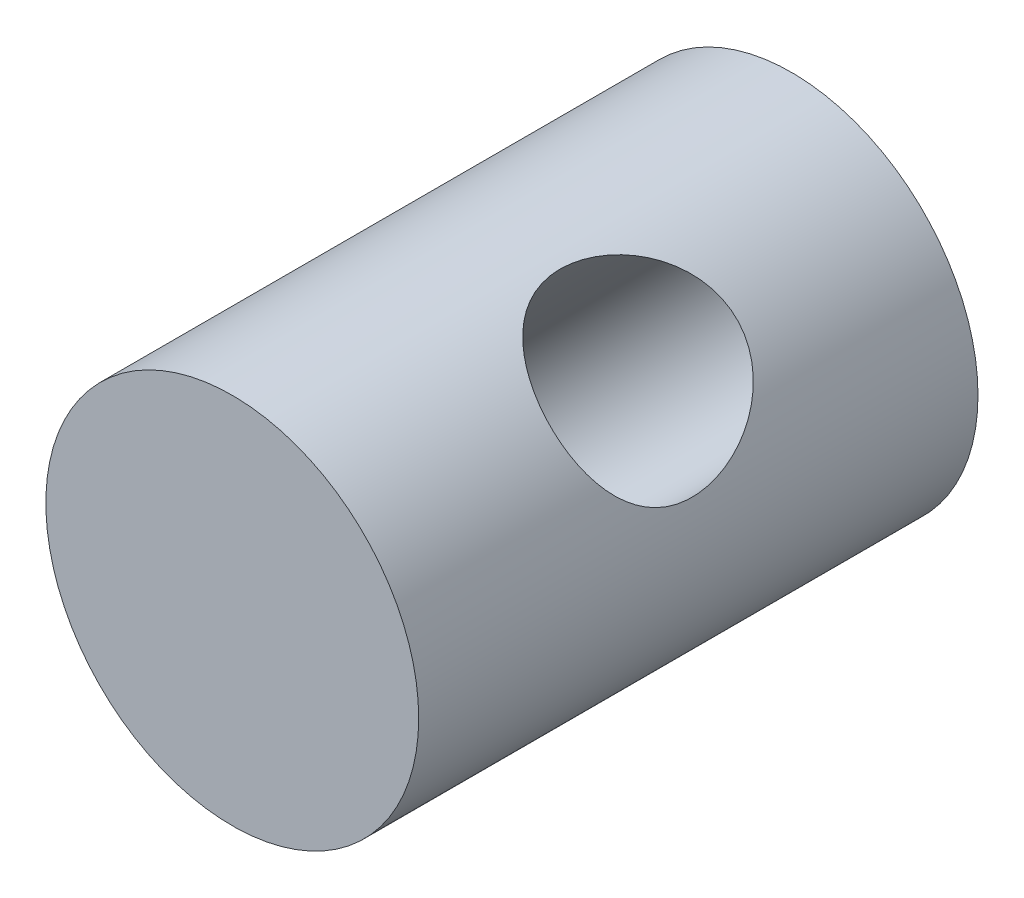
ISO-10303-21;
HEADER;
FILE_DESCRIPTION(('STEP AP214'),'2;1');
FILE_NAME('part.step','',(''),(''),'','','');
FILE_SCHEMA(('AUTOMOTIVE_DESIGN { 1 0 10303 214 1 1 1 1 }'));
ENDSEC;
DATA;
#1=APPLICATION_CONTEXT('core data for automotive mechanical design processes');
#2=APPLICATION_PROTOCOL_DEFINITION('international standard','automotive_design',2000,#1);
#3=PRODUCT_CONTEXT('',#1,'mechanical');
#4=PRODUCT('Part','Part','',(#3));
#5=PRODUCT_RELATED_PRODUCT_CATEGORY('part','',(#4));
#6=PRODUCT_DEFINITION_FORMATION('','',#4);
#7=PRODUCT_DEFINITION_CONTEXT('part definition',#1,'design');
#8=PRODUCT_DEFINITION('design','',#6,#7);
#9=PRODUCT_DEFINITION_SHAPE('','',#8);
#10=(LENGTH_UNIT() NAMED_UNIT(*) SI_UNIT(.MILLI.,.METRE.));
#11=(NAMED_UNIT(*) PLANE_ANGLE_UNIT() SI_UNIT($,.RADIAN.));
#12=(NAMED_UNIT(*) SI_UNIT($,.STERADIAN.) SOLID_ANGLE_UNIT());
#13=UNCERTAINTY_MEASURE_WITH_UNIT(LENGTH_MEASURE(1.E-05),#10,'distance_accuracy_value','');
#14=(GEOMETRIC_REPRESENTATION_CONTEXT(3) GLOBAL_UNCERTAINTY_ASSIGNED_CONTEXT((#13)) GLOBAL_UNIT_ASSIGNED_CONTEXT((#10,
#11,#12)) REPRESENTATION_CONTEXT('',''));
#15=CARTESIAN_POINT('',(0.,0.,0.));
#16=DIRECTION('',(0.,0.,1.));
#17=DIRECTION('',(1.,0.,0.));
#18=AXIS2_PLACEMENT_3D('',#15,#16,#17);
#19=CARTESIAN_POINT('',(0.,0.,12.));
#20=DIRECTION('',(0.,0.,-1.));
#21=DIRECTION('',(-1.,0.,0.));
#22=AXIS2_PLACEMENT_3D('',#19,#20,#21);
#23=CYLINDRICAL_SURFACE('',#22,4.);
#24=CARTESIAN_POINT('',(-3.86370330515627,-1.03527618041009,6.));
#25=CARTESIAN_POINT('',(-3.86370459881444,-1.0352893711571,6.10421320547434));
#26=CARTESIAN_POINT('',(-3.86128100934837,-1.04445095043979,6.2085621765338));
#27=CARTESIAN_POINT('',(-3.8513940803619,-1.08031794598724,6.4140551772306));
#28=CARTESIAN_POINT('',(-3.84392015002066,-1.1070602266733,6.51519200324776));
#29=CARTESIAN_POINT('',(-3.82345847525807,-1.17576810402632,6.71090315644693));
#30=CARTESIAN_POINT('',(-3.81049999591903,-1.21765273191303,6.80550925884925));
#31=CARTESIAN_POINT('',(-3.77834613351914,-1.31402940114761,6.98684845047615));
#32=CARTESIAN_POINT('',(-3.75915041303457,-1.36852212452518,7.07358111343677));
#33=CARTESIAN_POINT('',(-3.71179474047926,-1.49242262258695,7.24461144313338));
#34=CARTESIAN_POINT('',(-3.68302601797015,-1.5626898672979,7.32811826759177));
#35=CARTESIAN_POINT('',(-3.6161067938154,-1.71185746004076,7.4828167805706));
#36=CARTESIAN_POINT('',(-3.57795163529628,-1.79076208249943,7.55400232620397));
#37=CARTESIAN_POINT('',(-3.48844672204306,-1.95971138096949,7.6867343011885));
#38=CARTESIAN_POINT('',(-3.43638092272623,-2.05014845548512,7.74730753542331));
#39=CARTESIAN_POINT('',(-3.32009909967182,-2.23353894528091,7.85028170678709));
#40=CARTESIAN_POINT('',(-3.25589078089575,-2.32649073298615,7.8926941123508));
#41=CARTESIAN_POINT('',(-3.12095657273504,-2.50423233896791,7.95500932253118));
#42=CARTESIAN_POINT('',(-3.05101952081114,-2.58913230708547,7.9762990526921));
#43=CARTESIAN_POINT('',(-2.90288047261229,-2.75418828042584,8.00033223736903));
#44=CARTESIAN_POINT('',(-2.82468350628804,-2.83434712692783,8.00308691359628));
#45=CARTESIAN_POINT('',(-2.66974853723372,-2.98040182849614,7.99050665205486));
#46=CARTESIAN_POINT('',(-2.59347500057566,-3.04693182899992,7.97672396895636));
#47=CARTESIAN_POINT('',(-2.43871042756156,-3.17216053387482,7.93423831219188));
#48=CARTESIAN_POINT('',(-2.36021922568681,-3.23085865182079,7.90553422204788));
#49=CARTESIAN_POINT('',(-2.20250531142357,-3.34040810707925,7.83383486782005));
#50=CARTESIAN_POINT('',(-2.12328750299556,-3.3911396448263,7.79064737365578));
#51=CARTESIAN_POINT('',(-1.96773626752486,-3.48370759115982,7.6914731675971));
#52=CARTESIAN_POINT('',(-1.89140388456175,-3.52554080478518,7.63548187339533));
#53=CARTESIAN_POINT('',(-1.73703649261151,-3.60428958213898,7.50620929693394));
#54=CARTESIAN_POINT('',(-1.65952260135772,-3.64036649555481,7.43179394334797));
#55=CARTESIAN_POINT('',(-1.51382940179714,-3.70332720013195,7.27082055013965));
#56=CARTESIAN_POINT('',(-1.4456572872441,-3.73020393016802,7.18425325545188));
#57=CARTESIAN_POINT('',(-1.3179568504757,-3.77728932408925,6.99470361515182));
#58=CARTESIAN_POINT('',(-1.25925236275468,-3.79696615323056,6.89102795389158));
#59=CARTESIAN_POINT('',(-1.16027085528413,-3.82838022178834,6.674124657282));
#60=CARTESIAN_POINT('',(-1.11997461107766,-3.84012575033586,6.56090713396488));
#61=CARTESIAN_POINT('',(-1.06386498780704,-3.85603227368294,6.33757097743442));
#62=CARTESIAN_POINT('',(-1.04636450399107,-3.86072054919911,6.2279177619129));
#63=CARTESIAN_POINT('',(-1.03189824566562,-3.86461594335437,6.00719731696691));
#64=CARTESIAN_POINT('',(-1.03491796578461,-3.86382693378153,5.8961311417604));
#65=CARTESIAN_POINT('',(-1.05968057724537,-3.8570969495911,5.68869216284256));
#66=CARTESIAN_POINT('',(-1.07933918703677,-3.85172899517205,5.59204109778422));
#67=CARTESIAN_POINT('',(-1.13313003382098,-3.83624732829456,5.40326442745801));
#68=CARTESIAN_POINT('',(-1.16726695795744,-3.82613207885531,5.31114029850652));
#69=CARTESIAN_POINT('',(-1.24976121811304,-3.80000571468505,5.12917733819489));
#70=CARTESIAN_POINT('',(-1.29870394849983,-3.78374322988911,5.03964196629395));
#71=CARTESIAN_POINT('',(-1.40753017427794,-3.74462291896735,4.86906145692096));
#72=CARTESIAN_POINT('',(-1.46741928775995,-3.7217617026214,4.78802071296949));
#73=CARTESIAN_POINT('',(-1.60377873262909,-3.66524154585663,4.62604246495734));
#74=CARTESIAN_POINT('',(-1.68138757944598,-3.63058476054877,4.54640569858222));
#75=CARTESIAN_POINT('',(-1.84404659815511,-3.5507322401369,4.40117552399527));
#76=CARTESIAN_POINT('',(-1.92909927002594,-3.5055329558257,4.33558685947316));
#77=CARTESIAN_POINT('',(-2.10559182003165,-3.4025256771348,4.21885254816729));
#78=CARTESIAN_POINT('',(-2.19714102664403,-3.3444163981957,4.16813376383323));
#79=CARTESIAN_POINT('',(-2.38056150742932,-3.21642497959979,4.08572419203039));
#80=CARTESIAN_POINT('',(-2.47243242721346,-3.14655324686928,4.0540166963159));
#81=CARTESIAN_POINT('',(-2.64414859154452,-3.00330136916831,4.01326287251486));
#82=CARTESIAN_POINT('',(-2.72432380326583,-2.93083135085755,4.00240425133572));
#83=CARTESIAN_POINT('',(-2.87869858365822,-2.77934729282199,3.99831346600433));
#84=CARTESIAN_POINT('',(-2.95290023480643,-2.70033555329973,4.00507513147113));
#85=CARTESIAN_POINT('',(-3.0884694356153,-2.54388975347637,4.03483282431641));
#86=CARTESIAN_POINT('',(-3.15036049200075,-2.46669480823201,4.05672973730905));
#87=CARTESIAN_POINT('',(-3.26593797100563,-2.31149669440089,4.11465395980667));
#88=CARTESIAN_POINT('',(-3.31962321548962,-2.23349341147187,4.15068329570691));
#89=CARTESIAN_POINT('',(-3.42053391102493,-2.07583342321291,4.2374542549914));
#90=CARTESIAN_POINT('',(-3.46738486763519,-1.99624869216631,4.28875921975186));
#91=CARTESIAN_POINT('',(-3.55201788731206,-1.8414569996925,4.40391528811809));
#92=CARTESIAN_POINT('',(-3.58979576730867,-1.76625206959521,4.46777215410157));
#93=CARTESIAN_POINT('',(-3.66026791477986,-1.61555786947553,4.61359663555941));
#94=CARTESIAN_POINT('',(-3.69208209776399,-1.54078515186373,4.69673418080029));
#95=CARTESIAN_POINT('',(-3.74666670664265,-1.40285481283078,4.87489222830609));
#96=CARTESIAN_POINT('',(-3.7694291430603,-1.33970747877439,4.96992313136052));
#97=CARTESIAN_POINT('',(-3.80767032151753,-1.2269184524633,5.17330889413024));
#98=CARTESIAN_POINT('',(-3.82289615256722,-1.17776662816843,5.28198991073527));
#99=CARTESIAN_POINT('',(-3.84024140403409,-1.11935207552343,5.45057811963094));
#100=CARTESIAN_POINT('',(-3.84510564702044,-1.10244115407729,5.50764782059068));
#101=CARTESIAN_POINT('',(-3.8531247587118,-1.0740809843713,5.62323255750019));
#102=CARTESIAN_POINT('',(-3.85628082270828,-1.06262791767177,5.68174655275425));
#103=CARTESIAN_POINT('',(-3.86032188599497,-1.04783389616825,5.78360078924729));
#104=CARTESIAN_POINT('',(-3.86159132004935,-1.04313310007072,5.82673305725007));
#105=CARTESIAN_POINT('',(-3.86328178867122,-1.03685139155021,5.9132356930929));
#106=CARTESIAN_POINT('',(-3.86370276648266,-1.03527068784068,5.9566060766667));
#107=CARTESIAN_POINT('',(-3.86370330515627,-1.03527618041009,6.));
#108=B_SPLINE_CURVE_WITH_KNOTS('',3,(#24,#25,#26,#27,#28,#29,#30,#31,#32,#33,#34,#35,#36,#37,
#38,#39,#40,#41,#42,#43,#44,#45,#46,#47,#48,#49,#50,#51,#52,#53,#54,#55,#56,#57,#58,#59,#60,#61,
#62,#63,#64,#65,#66,#67,#68,#69,#70,#71,#72,#73,#74,#75,#76,#77,#78,#79,#80,#81,#82,#83,#84,#85,
#86,#87,#88,#89,#90,#91,#92,#93,#94,#95,#96,#97,#98,#99,#100,#101,#102,#103,#104,#105,#106,
#107),.UNSPECIFIED.,.T.,.F.,(4,2,2,2,2,2,2,2,2,2,2,2,2,2,2,2,2,2,2,2,2,2,2,2,2,2,2,2,2,2,2,2,2,
2,2,2,2,2,2,2,2,4),(0.,0.312464245189432,0.62558578564961,0.937057191861536,1.24854545093096,
1.58572462503713,1.92307142172809,2.28315784481594,2.64301653931849,2.97726969939937,
3.31132047376147,3.61632194973143,3.92134625038977,4.2305906946636,4.5399459870461,
4.87854382917848,5.21740096495904,5.57777683462963,5.93777548427476,6.2692458171249,
6.60048186380813,6.89548366852118,7.19058104876193,7.49934592816242,7.80826972444161,
8.15613487165293,8.50411729960471,8.86128362829998,9.2181355962161,9.5422454078304,
9.8662417359201,10.1688884974705,10.4715786702809,10.7872150144301,11.1029966020551,
11.450204837042,11.7977188569438,12.1562149808128,12.3351395323571,12.5139387197526,
12.6440387634036,12.7741475095882),.UNSPECIFIED.);
#109=CARTESIAN_POINT('',(-3.86370330515627,-1.03527618041009,6.));
#110=VERTEX_POINT('',#109);
#111=EDGE_CURVE('E35',#110,#110,#108,.T.);
#112=ORIENTED_EDGE('',*,*,#111,.T.);
#113=EDGE_LOOP('',(#112));
#114=FACE_BOUND('',#113,.T.);
#115=CARTESIAN_POINT('',(1.03527618041008,3.86370330515628,6.));
#116=CARTESIAN_POINT('',(1.03528937115708,3.86370459881445,5.89578679452566));
#117=CARTESIAN_POINT('',(1.04445095043978,3.86128100934838,5.7914378234662));
#118=CARTESIAN_POINT('',(1.08031794598723,3.8513940803619,5.5859448227694));
#119=CARTESIAN_POINT('',(1.10706022667329,3.84392015002067,5.48480799675224));
#120=CARTESIAN_POINT('',(1.17576810402631,3.82345847525807,5.28909684355307));
#121=CARTESIAN_POINT('',(1.21765273191302,3.81049999591904,5.19449074115075));
#122=CARTESIAN_POINT('',(1.3140294011476,3.77834613351914,5.01315154952385));
#123=CARTESIAN_POINT('',(1.36852212452517,3.75915041303458,4.92641888656323));
#124=CARTESIAN_POINT('',(1.49242262258694,3.71179474047926,4.75538855686662));
#125=CARTESIAN_POINT('',(1.56268986729789,3.68302601797015,4.67188173240823));
#126=CARTESIAN_POINT('',(1.71185746004075,3.61610679381541,4.5171832194294));
#127=CARTESIAN_POINT('',(1.79076208249942,3.57795163529629,4.44599767379603));
#128=CARTESIAN_POINT('',(1.95971138096948,3.48844672204306,4.3132656988115));
#129=CARTESIAN_POINT('',(2.0501484554851,3.43638092272623,4.25269246457669));
#130=CARTESIAN_POINT('',(2.2335389452809,3.32009909967182,4.14971829321291));
#131=CARTESIAN_POINT('',(2.32649073298614,3.25589078089575,4.1073058876492));
#132=CARTESIAN_POINT('',(2.5042323389679,3.12095657273504,4.04499067746882));
#133=CARTESIAN_POINT('',(2.58913230708546,3.05101952081115,4.0237009473079));
#134=CARTESIAN_POINT('',(2.75418828042583,2.9028804726123,3.99966776263097));
#135=CARTESIAN_POINT('',(2.83434712692782,2.82468350628805,3.99691308640372));
#136=CARTESIAN_POINT('',(2.98040182849614,2.66974853723373,4.00949334794514));
#137=CARTESIAN_POINT('',(3.04693182899991,2.59347500057567,4.02327603104364));
#138=CARTESIAN_POINT('',(3.17216053387481,2.43871042756157,4.06576168780812));
#139=CARTESIAN_POINT('',(3.23085865182079,2.36021922568682,4.09446577795212));
#140=CARTESIAN_POINT('',(3.34040810707925,2.20250531142358,4.16616513217995));
#141=CARTESIAN_POINT('',(3.39113964482629,2.12328750299557,4.20935262634422));
#142=CARTESIAN_POINT('',(3.48370759115981,1.96773626752487,4.3085268324029));
#143=CARTESIAN_POINT('',(3.52554080478517,1.89140388456176,4.36451812660468));
#144=CARTESIAN_POINT('',(3.60428958213898,1.73703649261152,4.49379070306606));
#145=CARTESIAN_POINT('',(3.64036649555481,1.65952260135774,4.56820605665203));
#146=CARTESIAN_POINT('',(3.70332720013195,1.51382940179715,4.72917944986035));
#147=CARTESIAN_POINT('',(3.73020393016802,1.44565728724411,4.81574674454812));
#148=CARTESIAN_POINT('',(3.77728932408925,1.31795685047571,5.00529638484818));
#149=CARTESIAN_POINT('',(3.79696615323056,1.2592523627547,5.10897204610842));
#150=CARTESIAN_POINT('',(3.82838022178833,1.16027085528414,5.325875342718));
#151=CARTESIAN_POINT('',(3.84012575033586,1.11997461107767,5.43909286603513));
#152=CARTESIAN_POINT('',(3.85603227368293,1.06386498780705,5.66242902256558));
#153=CARTESIAN_POINT('',(3.8607205491991,1.04636450399108,5.7720822380871));
#154=CARTESIAN_POINT('',(3.86461594335437,1.03189824566564,5.99280268303309));
#155=CARTESIAN_POINT('',(3.86382693378152,1.03491796578462,6.1038688582396));
#156=CARTESIAN_POINT('',(3.8570969495911,1.05968057724539,6.31130783715744));
#157=CARTESIAN_POINT('',(3.85172899517205,1.07933918703678,6.40795890221578));
#158=CARTESIAN_POINT('',(3.83624732829456,1.133130033821,6.59673557254199));
#159=CARTESIAN_POINT('',(3.82613207885531,1.16726695795746,6.68885970149348));
#160=CARTESIAN_POINT('',(3.80000571468505,1.24976121811306,6.87082266180511));
#161=CARTESIAN_POINT('',(3.7837432298891,1.29870394849984,6.96035803370605));
#162=CARTESIAN_POINT('',(3.74462291896735,1.40753017427796,7.13093854307904));
#163=CARTESIAN_POINT('',(3.7217617026214,1.46741928775996,7.21197928703051));
#164=CARTESIAN_POINT('',(3.66524154585663,1.6037787326291,7.37395753504266));
#165=CARTESIAN_POINT('',(3.63058476054876,1.68138757944599,7.45359430141778));
#166=CARTESIAN_POINT('',(3.5507322401369,1.84404659815512,7.59882447600473));
#167=CARTESIAN_POINT('',(3.50553295582569,1.92909927002595,7.66441314052684));
#168=CARTESIAN_POINT('',(3.4025256771348,2.10559182003166,7.78114745183271));
#169=CARTESIAN_POINT('',(3.34441639819569,2.19714102664404,7.83186623616677));
#170=CARTESIAN_POINT('',(3.21642497959979,2.38056150742934,7.91427580796961));
#171=CARTESIAN_POINT('',(3.14655324686927,2.47243242721347,7.9459833036841));
#172=CARTESIAN_POINT('',(3.0033013691683,2.64414859154453,7.98673712748514));
#173=CARTESIAN_POINT('',(2.93083135085754,2.72432380326584,7.99759574866427));
#174=CARTESIAN_POINT('',(2.77934729282198,2.87869858365823,8.00168653399567));
#175=CARTESIAN_POINT('',(2.70033555329972,2.95290023480644,7.99492486852887));
#176=CARTESIAN_POINT('',(2.54388975347636,3.08846943561531,7.9651671756836));
#177=CARTESIAN_POINT('',(2.466694808232,3.15036049200076,7.94327026269095));
#178=CARTESIAN_POINT('',(2.31149669440088,3.26593797100564,7.88534604019333));
#179=CARTESIAN_POINT('',(2.23349341147186,3.31962321548963,7.84931670429309));
#180=CARTESIAN_POINT('',(2.0758334232129,3.42053391102494,7.7625457450086));
#181=CARTESIAN_POINT('',(1.99624869216629,3.4673848676352,7.71124078024814));
#182=CARTESIAN_POINT('',(1.84145699969248,3.55201788731207,7.5960847118819));
#183=CARTESIAN_POINT('',(1.7662520695952,3.58979576730868,7.53222784589843));
#184=CARTESIAN_POINT('',(1.61555786947552,3.66026791477986,7.38640336444058));
#185=CARTESIAN_POINT('',(1.54078515186371,3.69208209776399,7.30326581919971));
#186=CARTESIAN_POINT('',(1.40285481283077,3.74666670664265,7.12510777169391));
#187=CARTESIAN_POINT('',(1.33970747877438,3.76942914306031,7.03007686863949));
#188=CARTESIAN_POINT('',(1.22691845246329,3.80767032151753,6.82669110586976));
#189=CARTESIAN_POINT('',(1.17776662816842,3.82289615256722,6.71801008926473));
#190=CARTESIAN_POINT('',(1.11935207552341,3.84024140403409,6.54942188036906));
#191=CARTESIAN_POINT('',(1.10244115407727,3.84510564702044,6.49235217940932));
#192=CARTESIAN_POINT('',(1.07408098437129,3.8531247587118,6.37676744249981));
#193=CARTESIAN_POINT('',(1.06262791767175,3.85628082270828,6.31825344724575));
#194=CARTESIAN_POINT('',(1.04783389616824,3.86032188599498,6.21639921075271));
#195=CARTESIAN_POINT('',(1.04313310007071,3.86159132004936,6.17326694274993));
#196=CARTESIAN_POINT('',(1.03685139155019,3.86328178867122,6.0867643069071));
#197=CARTESIAN_POINT('',(1.03527068784067,3.86370276648267,6.0433939233333));
#198=CARTESIAN_POINT('',(1.03527618041008,3.86370330515628,6.));
#199=B_SPLINE_CURVE_WITH_KNOTS('',3,(#115,#116,#117,#118,#119,#120,#121,#122,#123,#124,#125,
#126,#127,#128,#129,#130,#131,#132,#133,#134,#135,#136,#137,#138,#139,#140,#141,#142,#143,#144,
#145,#146,#147,#148,#149,#150,#151,#152,#153,#154,#155,#156,#157,#158,#159,#160,#161,#162,#163,
#164,#165,#166,#167,#168,#169,#170,#171,#172,#173,#174,#175,#176,#177,#178,#179,#180,#181,#182,
#183,#184,#185,#186,#187,#188,#189,#190,#191,#192,#193,#194,#195,#196,#197,#198),.UNSPECIFIED.,
.T.,.F.,(4,2,2,2,2,2,2,2,2,2,2,2,2,2,2,2,2,2,2,2,2,2,2,2,2,2,2,2,2,2,2,2,2,2,2,2,2,2,2,2,2,4),
(0.,0.312464245189432,0.62558578564961,0.937057191861535,1.24854545093096,1.58572462503713,
1.92307142172808,2.28315784481594,2.64301653931849,2.97726969939937,3.31132047376147,
3.61632194973143,3.92134625038977,4.2305906946636,4.5399459870461,4.87854382917848,
5.21740096495904,5.57777683462963,5.93777548427476,6.2692458171249,6.60048186380812,
6.89548366852117,7.19058104876193,7.49934592816242,7.80826972444161,8.15613487165293,
8.50411729960471,8.86128362829998,9.2181355962161,9.5422454078304,9.8662417359201,
10.1688884974705,10.4715786702809,10.7872150144301,11.102996602055,11.450204837042,
11.7977188569437,12.1562149808128,12.3351395323571,12.5139387197526,12.6440387634036,
12.7741475095882),.UNSPECIFIED.);
#200=CARTESIAN_POINT('',(1.03527618041008,3.86370330515628,6.));
#201=VERTEX_POINT('',#200);
#202=EDGE_CURVE('E10',#201,#201,#199,.T.);
#203=ORIENTED_EDGE('',*,*,#202,.T.);
#204=EDGE_LOOP('',(#203));
#205=FACE_BOUND('',#204,.T.);
#206=CARTESIAN_POINT('',(0.,0.,12.));
#207=DIRECTION('',(0.,0.,1.));
#208=DIRECTION('',(1.,0.,0.));
#209=AXIS2_PLACEMENT_3D('',#206,#207,#208);
#210=CIRCLE('',#209,4.);
#211=CARTESIAN_POINT('',(4.,0.,12.));
#212=VERTEX_POINT('',#211);
#213=EDGE_CURVE('E42',#212,#212,#210,.T.);
#214=ORIENTED_EDGE('',*,*,#213,.F.);
#215=EDGE_LOOP('',(#214));
#216=FACE_BOUND('',#215,.T.);
#217=CARTESIAN_POINT('',(0.,0.,0.));
#218=DIRECTION('',(0.,0.,1.));
#219=DIRECTION('',(1.,0.,0.));
#220=AXIS2_PLACEMENT_3D('',#217,#218,#219);
#221=CIRCLE('',#220,4.);
#222=CARTESIAN_POINT('',(4.,0.,0.));
#223=VERTEX_POINT('',#222);
#224=EDGE_CURVE('E46',#223,#223,#221,.T.);
#225=ORIENTED_EDGE('',*,*,#224,.T.);
#226=EDGE_LOOP('',(#225));
#227=FACE_BOUND('',#226,.T.);
#228=ADVANCED_FACE('F31',(#114,#205,#216,#227),#23,.T.);
#229=CARTESIAN_POINT('',(0.,0.,12.));
#230=DIRECTION('',(0.,0.,1.));
#231=DIRECTION('',(1.,0.,0.));
#232=AXIS2_PLACEMENT_3D('',#229,#230,#231);
#233=PLANE('',#232);
#234=ORIENTED_EDGE('',*,*,#213,.T.);
#235=EDGE_LOOP('',(#234));
#236=FACE_BOUND('',#235,.T.);
#237=ADVANCED_FACE('F57',(#236),#233,.T.);
#238=CARTESIAN_POINT('',(0.,0.,0.));
#239=DIRECTION('',(0.,0.,1.));
#240=DIRECTION('',(1.,0.,0.));
#241=AXIS2_PLACEMENT_3D('',#238,#239,#240);
#242=PLANE('',#241);
#243=ORIENTED_EDGE('',*,*,#224,.F.);
#244=EDGE_LOOP('',(#243));
#245=FACE_BOUND('',#244,.T.);
#246=ADVANCED_FACE('F55',(#245),#242,.F.);
#247=CARTESIAN_POINT('',(-3.99999999999999,-4.00000000000001,6.));
#248=DIRECTION('',(0.707106781186546,0.707106781186549,0.));
#249=DIRECTION('',(-0.707106781186549,0.707106781186546,0.));
#250=AXIS2_PLACEMENT_3D('',#247,#248,#249);
#251=CYLINDRICAL_SURFACE('',#250,2.);
#252=ORIENTED_EDGE('',*,*,#202,.F.);
#253=EDGE_LOOP('',(#252));
#254=FACE_BOUND('',#253,.T.);
#255=ORIENTED_EDGE('',*,*,#111,.F.);
#256=EDGE_LOOP('',(#255));
#257=FACE_BOUND('',#256,.T.);
#258=ADVANCED_FACE('F51',(#254,#257),#251,.F.);
#259=CLOSED_SHELL('',(#228,#237,#246,#258));
#260=MANIFOLD_SOLID_BREP('B2',#259);
#261=ADVANCED_BREP_SHAPE_REPRESENTATION('',(#18,#260),#14);
#262=SHAPE_DEFINITION_REPRESENTATION(#9,#261);
ENDSEC;
END-ISO-10303-21;
